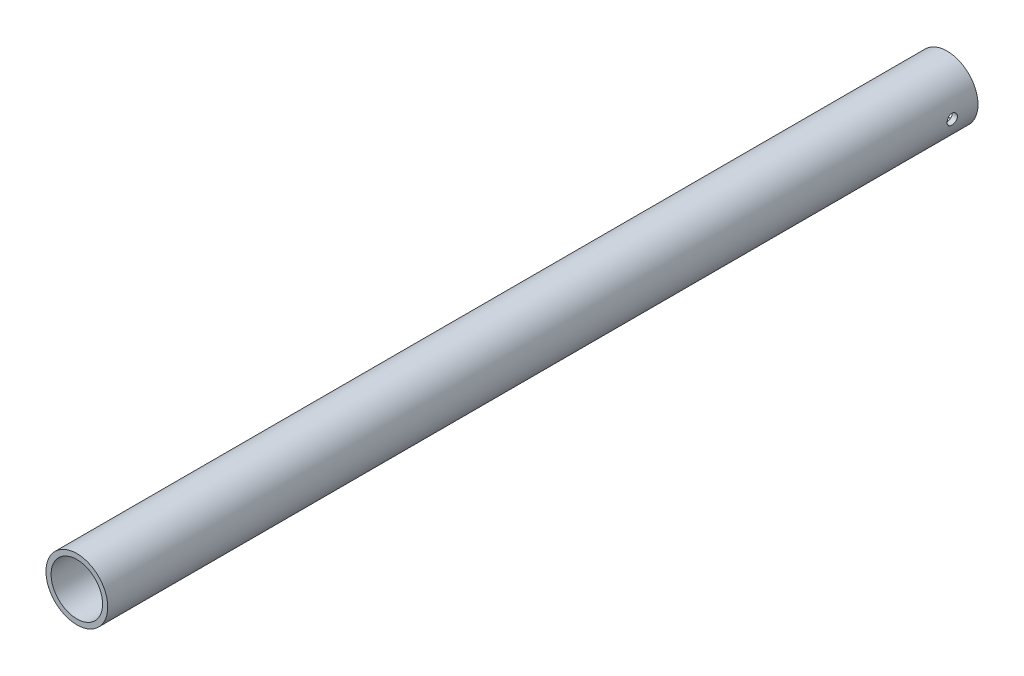
ISO-10303-21;
HEADER;
FILE_DESCRIPTION(('STEP AP214'),'2;1');
FILE_NAME('part.step','',(''),(''),'','','');
FILE_SCHEMA(('AUTOMOTIVE_DESIGN { 1 0 10303 214 1 1 1 1 }'));
ENDSEC;
DATA;
#1=APPLICATION_CONTEXT('core data for automotive mechanical design processes');
#2=APPLICATION_PROTOCOL_DEFINITION('international standard','automotive_design',2000,#1);
#3=PRODUCT_CONTEXT('',#1,'mechanical');
#4=PRODUCT('Part','Part','',(#3));
#5=PRODUCT_RELATED_PRODUCT_CATEGORY('part','',(#4));
#6=PRODUCT_DEFINITION_FORMATION('','',#4);
#7=PRODUCT_DEFINITION_CONTEXT('part definition',#1,'design');
#8=PRODUCT_DEFINITION('design','',#6,#7);
#9=PRODUCT_DEFINITION_SHAPE('','',#8);
#10=(LENGTH_UNIT() NAMED_UNIT(*) SI_UNIT(.MILLI.,.METRE.));
#11=(NAMED_UNIT(*) PLANE_ANGLE_UNIT() SI_UNIT($,.RADIAN.));
#12=(NAMED_UNIT(*) SI_UNIT($,.STERADIAN.) SOLID_ANGLE_UNIT());
#13=UNCERTAINTY_MEASURE_WITH_UNIT(LENGTH_MEASURE(1.E-05),#10,'distance_accuracy_value','');
#14=(GEOMETRIC_REPRESENTATION_CONTEXT(3) GLOBAL_UNCERTAINTY_ASSIGNED_CONTEXT((#13)) GLOBAL_UNIT_ASSIGNED_CONTEXT((#10,
#11,#12)) REPRESENTATION_CONTEXT('',''));
#15=CARTESIAN_POINT('',(0.,0.,0.));
#16=DIRECTION('',(0.,0.,1.));
#17=DIRECTION('',(1.,0.,0.));
#18=AXIS2_PLACEMENT_3D('',#15,#16,#17);
#19=CARTESIAN_POINT('',(0.,0.,169.));
#20=DIRECTION('',(0.,0.,1.));
#21=DIRECTION('',(1.,0.,0.));
#22=AXIS2_PLACEMENT_3D('',#19,#20,#21);
#23=PLANE('',#22);
#24=CARTESIAN_POINT('',(0.,0.,169.));
#25=DIRECTION('',(0.,0.,1.));
#26=DIRECTION('',(1.,0.,0.));
#27=AXIS2_PLACEMENT_3D('',#24,#25,#26);
#28=CIRCLE('',#27,6.);
#29=CARTESIAN_POINT('',(6.,0.,169.));
#30=VERTEX_POINT('',#29);
#31=EDGE_CURVE('E10',#30,#30,#28,.T.);
#32=ORIENTED_EDGE('',*,*,#31,.T.);
#33=EDGE_LOOP('',(#32));
#34=FACE_BOUND('',#33,.T.);
#35=CARTESIAN_POINT('',(0.,0.,169.));
#36=DIRECTION('',(0.,0.,1.));
#37=DIRECTION('',(1.,0.,0.));
#38=AXIS2_PLACEMENT_3D('',#35,#36,#37);
#39=CIRCLE('',#38,5.);
#40=CARTESIAN_POINT('',(5.,0.,169.));
#41=VERTEX_POINT('',#40);
#42=EDGE_CURVE('E49',#41,#41,#39,.T.);
#43=ORIENTED_EDGE('',*,*,#42,.F.);
#44=EDGE_LOOP('',(#43));
#45=FACE_BOUND('',#44,.T.);
#46=ADVANCED_FACE('F30',(#34,#45),#23,.T.);
#47=CARTESIAN_POINT('',(0.,0.,0.));
#48=DIRECTION('',(0.,0.,1.));
#49=DIRECTION('',(1.,0.,0.));
#50=AXIS2_PLACEMENT_3D('',#47,#48,#49);
#51=PLANE('',#50);
#52=CARTESIAN_POINT('',(0.,0.,0.));
#53=DIRECTION('',(0.,0.,1.));
#54=DIRECTION('',(1.,0.,0.));
#55=AXIS2_PLACEMENT_3D('',#52,#53,#54);
#56=CIRCLE('',#55,6.);
#57=CARTESIAN_POINT('',(6.,0.,0.));
#58=VERTEX_POINT('',#57);
#59=EDGE_CURVE('E44',#58,#58,#56,.T.);
#60=ORIENTED_EDGE('',*,*,#59,.F.);
#61=EDGE_LOOP('',(#60));
#62=FACE_BOUND('',#61,.T.);
#63=CARTESIAN_POINT('',(0.,0.,0.));
#64=DIRECTION('',(0.,0.,1.));
#65=DIRECTION('',(1.,0.,0.));
#66=AXIS2_PLACEMENT_3D('',#63,#64,#65);
#67=CIRCLE('',#66,5.);
#68=CARTESIAN_POINT('',(5.,0.,0.));
#69=VERTEX_POINT('',#68);
#70=EDGE_CURVE('E52',#69,#69,#67,.T.);
#71=ORIENTED_EDGE('',*,*,#70,.T.);
#72=EDGE_LOOP('',(#71));
#73=FACE_BOUND('',#72,.T.);
#74=ADVANCED_FACE('F88',(#62,#73),#51,.F.);
#75=CARTESIAN_POINT('',(0.,0.,169.));
#76=DIRECTION('',(0.,0.,-1.));
#77=DIRECTION('',(-1.,0.,0.));
#78=AXIS2_PLACEMENT_3D('',#75,#76,#77);
#79=CYLINDRICAL_SURFACE('',#78,6.);
#80=CARTESIAN_POINT('',(-6.,0.,4.));
#81=CARTESIAN_POINT('',(-5.9999990446753,0.0557563619832858,4.00000223557913));
#82=CARTESIAN_POINT('',(-5.99921471165214,0.111543152735528,4.00467890998757));
#83=CARTESIAN_POINT('',(-5.99616137976555,0.221552088669217,4.02325426350613));
#84=CARTESIAN_POINT('',(-5.99389101569556,0.275772747183699,4.03716142276464));
#85=CARTESIAN_POINT('',(-5.9881202729458,0.381041898885057,4.0737661794371));
#86=CARTESIAN_POINT('',(-5.98462090063677,0.43209294737276,4.09645658625623));
#87=CARTESIAN_POINT('',(-5.97677690832828,0.529656736791177,4.14996491682096));
#88=CARTESIAN_POINT('',(-5.97243238501774,0.576169995951436,4.1807819109932));
#89=CARTESIAN_POINT('',(-5.96333326983325,0.663789045716672,4.24998203352818));
#90=CARTESIAN_POINT('',(-5.95857548725943,0.704845161413987,4.28842764585445));
#91=CARTESIAN_POINT('',(-5.94921050750693,0.779955399463971,4.37165918738912));
#92=CARTESIAN_POINT('',(-5.94460331985067,0.814009079756388,4.41644551658264));
#93=CARTESIAN_POINT('',(-5.93603026303912,0.874346850242053,4.51142838647882));
#94=CARTESIAN_POINT('',(-5.93206851636654,0.9005818211444,4.5616565347219));
#95=CARTESIAN_POINT('',(-5.9252791591787,0.944223346164487,4.66588382572025));
#96=CARTESIAN_POINT('',(-5.92245147205723,0.961630496626245,4.71988271347105));
#97=CARTESIAN_POINT('',(-5.91828214737102,0.986965751113923,4.82959210994261));
#98=CARTESIAN_POINT('',(-5.9169270739428,0.99497961165416,4.88528229460056));
#99=CARTESIAN_POINT('',(-5.9158157557466,1.00156669011595,4.99723211075339));
#100=CARTESIAN_POINT('',(-5.91605939782886,1.0001405761556,5.05349170166692));
#101=CARTESIAN_POINT('',(-5.91810571545422,0.98795803935846,5.16437114451018));
#102=CARTESIAN_POINT('',(-5.91989229327567,0.977297952755909,5.21900192141809));
#103=CARTESIAN_POINT('',(-5.92479798084403,0.947101256161378,5.32568852713165));
#104=CARTESIAN_POINT('',(-5.92791713629309,0.927564341727896,5.37774426755542));
#105=CARTESIAN_POINT('',(-5.9351539173364,0.880070898437565,5.47809152937637));
#106=CARTESIAN_POINT('',(-5.9392762684293,0.852074365551885,5.52636376243249));
#107=CARTESIAN_POINT('',(-5.94805167366004,0.788484807022974,5.61756176021535));
#108=CARTESIAN_POINT('',(-5.95270477061715,0.752891168261715,5.66048709298197));
#109=CARTESIAN_POINT('',(-5.96208811151914,0.674592884863622,5.74033043432294));
#110=CARTESIAN_POINT('',(-5.96681859692661,0.631805585549251,5.77716740741603));
#111=CARTESIAN_POINT('',(-5.97577040558689,0.540614099592659,5.84315110506614));
#112=CARTESIAN_POINT('',(-5.97999172555898,0.492209876762569,5.87229778007329));
#113=CARTESIAN_POINT('',(-5.98745557157165,0.391082366466684,5.92208089085451));
#114=CARTESIAN_POINT('',(-5.99069727362979,0.338355490225864,5.9427101677325));
#115=CARTESIAN_POINT('',(-5.99583001205064,0.230119338241092,5.97479768609839));
#116=CARTESIAN_POINT('',(-5.9977211614019,0.174610295671787,5.98625669478949));
#117=CARTESIAN_POINT('',(-5.99992451937074,0.0630839605206495,5.99956854338445));
#118=CARTESIAN_POINT('',(-6.00025501205114,0.0070802948604045,6.00153262872224));
#119=CARTESIAN_POINT('',(-5.99934989768468,-0.104455909155955,5.99609546222875));
#120=CARTESIAN_POINT('',(-5.99811435089647,-0.159988465556816,5.98869457074651));
#121=CARTESIAN_POINT('',(-5.99422730775281,-0.268662470218705,5.96483006026581));
#122=CARTESIAN_POINT('',(-5.99158441920524,-0.321816347354152,5.94842151664395));
#123=CARTESIAN_POINT('',(-5.98517785782144,-0.424618753944177,5.90706619272019));
#124=CARTESIAN_POINT('',(-5.98141412204808,-0.474267086363888,5.88211893294589));
#125=CARTESIAN_POINT('',(-5.97313806520963,-0.569132275787583,5.82413955012129));
#126=CARTESIAN_POINT('',(-5.96861942354809,-0.614306100374859,5.7910379375331));
#127=CARTESIAN_POINT('',(-5.9593538695676,-0.698497434201075,5.71778507384598));
#128=CARTESIAN_POINT('',(-5.95460694068619,-0.737514495878633,5.67763331068933));
#129=CARTESIAN_POINT('',(-5.94536070094338,-0.8086971118632,5.59092098077143));
#130=CARTESIAN_POINT('',(-5.94086446454842,-0.840787504445486,5.54429833379424));
#131=CARTESIAN_POINT('',(-5.93268611911154,-0.896680924117994,5.44625881234458));
#132=CARTESIAN_POINT('',(-5.92900398426408,-0.920484213907929,5.394842089909));
#133=CARTESIAN_POINT('',(-5.92289381479082,-0.959015332589259,5.28888410687515));
#134=CARTESIAN_POINT('',(-5.92046061724426,-0.973780573019178,5.2343567619878));
#135=CARTESIAN_POINT('',(-5.91711086734105,-0.993934181511311,5.1235519483113));
#136=CARTESIAN_POINT('',(-5.91619418313089,-0.999323364778467,5.06727463210718));
#137=CARTESIAN_POINT('',(-5.91598693233605,-1.00054914641894,4.95531793361504));
#138=CARTESIAN_POINT('',(-5.9166762260226,-0.996504054450074,4.89963984856988));
#139=CARTESIAN_POINT('',(-5.91955912581491,-0.979231935582739,4.78976830077969));
#140=CARTESIAN_POINT('',(-5.92175272704486,-0.96600493844499,4.73557483322325));
#141=CARTESIAN_POINT('',(-5.92738942512688,-0.93078979583796,4.63025662508295));
#142=CARTESIAN_POINT('',(-5.93083106887868,-0.908811836240177,4.57912839597759));
#143=CARTESIAN_POINT('',(-5.93857747568883,-0.856730801566364,4.48126573232206));
#144=CARTESIAN_POINT('',(-5.9428822815536,-0.826627323499425,4.43453151585115));
#145=CARTESIAN_POINT('',(-5.95193381618249,-0.758727553748862,4.3461857667569));
#146=CARTESIAN_POINT('',(-5.95668518230521,-0.720844225437459,4.30464159331989));
#147=CARTESIAN_POINT('',(-5.96605748944336,-0.638643612552092,4.22845935821003));
#148=CARTESIAN_POINT('',(-5.97067840010619,-0.594324845165054,4.19382289254473));
#149=CARTESIAN_POINT('',(-5.97930611856888,-0.500147667856112,4.13222069272002));
#150=CARTESIAN_POINT('',(-5.98330846501242,-0.450253115013127,4.10530958427482));
#151=CARTESIAN_POINT('',(-5.9902046704071,-0.346605227751592,4.06029220615603));
#152=CARTESIAN_POINT('',(-5.99309963270993,-0.292855797932004,4.04217716756812));
#153=CARTESIAN_POINT('',(-5.99682316333182,-0.19908132401816,4.01919789034933));
#154=CARTESIAN_POINT('',(-5.99800810909344,-0.159623532119379,4.01201021215361));
#155=CARTESIAN_POINT('',(-5.99959686394448,-0.0801157241279235,4.0024105048621));
#156=CARTESIAN_POINT('',(-6.00000068648257,-0.0400657182433976,3.99999839354506));
#157=CARTESIAN_POINT('',(-6.,0.,4.));
#158=B_SPLINE_CURVE_WITH_KNOTS('',3,(#80,#81,#82,#83,#84,#85,#86,#87,#88,#89,#90,#91,#92,#93,
#94,#95,#96,#97,#98,#99,#100,#101,#102,#103,#104,#105,#106,#107,#108,#109,#110,#111,#112,#113,
#114,#115,#116,#117,#118,#119,#120,#121,#122,#123,#124,#125,#126,#127,#128,#129,#130,#131,#132,
#133,#134,#135,#136,#137,#138,#139,#140,#141,#142,#143,#144,#145,#146,#147,#148,#149,#150,#151,
#152,#153,#154,#155,#156,#157),.UNSPECIFIED.,.T.,.F.,(4,2,2,2,2,2,2,2,2,2,2,2,2,2,2,2,2,2,2,2,2,
2,2,2,2,2,2,2,2,2,2,2,2,2,2,2,2,2,4),(0.,0.167122633975404,0.334399018278168,0.501538746810108,
0.668659365069916,0.837209964249328,1.00577120067943,1.17537008329536,1.34495750750472,
1.51298430841369,1.68099921728354,1.84728208704163,2.01357066010152,2.18065822653023,
2.34775928272229,2.51693107964531,2.68610396654339,2.85541875566361,3.02471937808459,
3.19203153396559,3.35933725214344,3.52563122802566,3.69193454330426,3.85970730250809,
4.02749225221713,4.19701528803047,4.36653294950377,4.53534408936709,4.70414055114647,
4.8708316380908,5.03752218475253,5.20401927290489,5.37052462011734,5.53900553677357,
5.70752533551589,5.8772089264288,6.04672300852029,6.16681699265607,6.28690890910787),.UNSPECIFIED.);
#159=CARTESIAN_POINT('',(-6.,0.,4.));
#160=VERTEX_POINT('',#159);
#161=EDGE_CURVE('E77',#160,#160,#158,.T.);
#162=ORIENTED_EDGE('',*,*,#161,.T.);
#163=EDGE_LOOP('',(#162));
#164=FACE_BOUND('',#163,.T.);
#165=CARTESIAN_POINT('',(6.,0.,4.));
#166=CARTESIAN_POINT('',(5.99999904467529,-0.0557563619832859,4.00000223557913));
#167=CARTESIAN_POINT('',(5.99921471165214,-0.111543152735528,4.00467890998757));
#168=CARTESIAN_POINT('',(5.99616137976555,-0.221552088669217,4.02325426350613));
#169=CARTESIAN_POINT('',(5.99389101569556,-0.275772747183699,4.03716142276464));
#170=CARTESIAN_POINT('',(5.9881202729458,-0.381041898885058,4.0737661794371));
#171=CARTESIAN_POINT('',(5.98462090063677,-0.43209294737276,4.09645658625623));
#172=CARTESIAN_POINT('',(5.97677690832828,-0.529656736791178,4.14996491682096));
#173=CARTESIAN_POINT('',(5.97243238501774,-0.576169995951436,4.1807819109932));
#174=CARTESIAN_POINT('',(5.96333326983325,-0.663789045716672,4.24998203352818));
#175=CARTESIAN_POINT('',(5.95857548725943,-0.704845161413987,4.28842764585445));
#176=CARTESIAN_POINT('',(5.94921050750693,-0.779955399463971,4.37165918738912));
#177=CARTESIAN_POINT('',(5.94460331985067,-0.814009079756389,4.41644551658264));
#178=CARTESIAN_POINT('',(5.93603026303912,-0.874346850242053,4.51142838647882));
#179=CARTESIAN_POINT('',(5.93206851636655,-0.9005818211444,4.5616565347219));
#180=CARTESIAN_POINT('',(5.9252791591787,-0.944223346164487,4.66588382572025));
#181=CARTESIAN_POINT('',(5.92245147205723,-0.961630496626245,4.71988271347105));
#182=CARTESIAN_POINT('',(5.91828214737102,-0.986965751113923,4.82959210994262));
#183=CARTESIAN_POINT('',(5.9169270739428,-0.99497961165416,4.88528229460056));
#184=CARTESIAN_POINT('',(5.9158157557466,-1.00156669011595,4.99723211075339));
#185=CARTESIAN_POINT('',(5.91605939782886,-1.0001405761556,5.05349170166692));
#186=CARTESIAN_POINT('',(5.91810571545422,-0.98795803935846,5.16437114451018));
#187=CARTESIAN_POINT('',(5.91989229327567,-0.977297952755909,5.21900192141809));
#188=CARTESIAN_POINT('',(5.92479798084403,-0.947101256161378,5.32568852713165));
#189=CARTESIAN_POINT('',(5.92791713629309,-0.927564341727896,5.37774426755542));
#190=CARTESIAN_POINT('',(5.9351539173364,-0.880070898437565,5.47809152937637));
#191=CARTESIAN_POINT('',(5.9392762684293,-0.852074365551885,5.52636376243249));
#192=CARTESIAN_POINT('',(5.94805167366004,-0.788484807022973,5.61756176021535));
#193=CARTESIAN_POINT('',(5.95270477061715,-0.752891168261715,5.66048709298197));
#194=CARTESIAN_POINT('',(5.96208811151914,-0.674592884863622,5.74033043432294));
#195=CARTESIAN_POINT('',(5.96681859692661,-0.631805585549251,5.77716740741603));
#196=CARTESIAN_POINT('',(5.97577040558689,-0.540614099592658,5.84315110506614));
#197=CARTESIAN_POINT('',(5.97999172555898,-0.492209876762569,5.87229778007329));
#198=CARTESIAN_POINT('',(5.98745557157165,-0.391082366466684,5.92208089085451));
#199=CARTESIAN_POINT('',(5.99069727362979,-0.338355490225864,5.9427101677325));
#200=CARTESIAN_POINT('',(5.99583001205064,-0.230119338241093,5.97479768609839));
#201=CARTESIAN_POINT('',(5.9977211614019,-0.174610295671787,5.98625669478949));
#202=CARTESIAN_POINT('',(5.99992451937074,-0.0630839605206495,5.99956854338445));
#203=CARTESIAN_POINT('',(6.00025501205114,-0.00708029486040434,6.00153262872224));
#204=CARTESIAN_POINT('',(5.99934989768468,0.104455909155955,5.99609546222875));
#205=CARTESIAN_POINT('',(5.99811435089647,0.159988465556816,5.98869457074651));
#206=CARTESIAN_POINT('',(5.99422730775281,0.268662470218706,5.96483006026581));
#207=CARTESIAN_POINT('',(5.99158441920524,0.321816347354152,5.94842151664395));
#208=CARTESIAN_POINT('',(5.98517785782144,0.424618753944177,5.90706619272019));
#209=CARTESIAN_POINT('',(5.98141412204808,0.474267086363888,5.88211893294589));
#210=CARTESIAN_POINT('',(5.97313806520963,0.569132275787584,5.82413955012129));
#211=CARTESIAN_POINT('',(5.96861942354809,0.614306100374859,5.7910379375331));
#212=CARTESIAN_POINT('',(5.9593538695676,0.698497434201075,5.71778507384598));
#213=CARTESIAN_POINT('',(5.95460694068619,0.737514495878633,5.67763331068933));
#214=CARTESIAN_POINT('',(5.94536070094338,0.808697111863201,5.59092098077143));
#215=CARTESIAN_POINT('',(5.94086446454842,0.840787504445486,5.54429833379424));
#216=CARTESIAN_POINT('',(5.93268611911154,0.896680924117994,5.44625881234458));
#217=CARTESIAN_POINT('',(5.92900398426408,0.920484213907929,5.394842089909));
#218=CARTESIAN_POINT('',(5.92289381479082,0.95901533258926,5.28888410687515));
#219=CARTESIAN_POINT('',(5.92046061724426,0.973780573019178,5.2343567619878));
#220=CARTESIAN_POINT('',(5.91711086734104,0.993934181511311,5.12355194831129));
#221=CARTESIAN_POINT('',(5.91619418313089,0.999323364778467,5.06727463210718));
#222=CARTESIAN_POINT('',(5.91598693233605,1.00054914641894,4.95531793361504));
#223=CARTESIAN_POINT('',(5.9166762260226,0.996504054450074,4.89963984856988));
#224=CARTESIAN_POINT('',(5.91955912581491,0.979231935582739,4.78976830077969));
#225=CARTESIAN_POINT('',(5.92175272704486,0.96600493844499,4.73557483322325));
#226=CARTESIAN_POINT('',(5.92738942512688,0.93078979583796,4.63025662508295));
#227=CARTESIAN_POINT('',(5.93083106887868,0.908811836240176,4.57912839597759));
#228=CARTESIAN_POINT('',(5.93857747568883,0.856730801566363,4.48126573232206));
#229=CARTESIAN_POINT('',(5.9428822815536,0.826627323499425,4.43453151585115));
#230=CARTESIAN_POINT('',(5.95193381618249,0.758727553748862,4.3461857667569));
#231=CARTESIAN_POINT('',(5.95668518230521,0.720844225437459,4.30464159331989));
#232=CARTESIAN_POINT('',(5.96605748944336,0.638643612552092,4.22845935821003));
#233=CARTESIAN_POINT('',(5.97067840010619,0.594324845165054,4.19382289254473));
#234=CARTESIAN_POINT('',(5.97930611856888,0.500147667856111,4.13222069272002));
#235=CARTESIAN_POINT('',(5.98330846501242,0.450253115013126,4.10530958427482));
#236=CARTESIAN_POINT('',(5.9902046704071,0.346605227751591,4.06029220615603));
#237=CARTESIAN_POINT('',(5.99309963270993,0.292855797932003,4.04217716756812));
#238=CARTESIAN_POINT('',(5.99682316333182,0.199081324018159,4.01919789034933));
#239=CARTESIAN_POINT('',(5.99800810909344,0.159623532119378,4.01201021215361));
#240=CARTESIAN_POINT('',(5.99959686394448,0.080115724127923,4.0024105048621));
#241=CARTESIAN_POINT('',(6.00000068648256,0.0400657182433974,3.99999839354506));
#242=CARTESIAN_POINT('',(6.,0.,4.));
#243=B_SPLINE_CURVE_WITH_KNOTS('',3,(#165,#166,#167,#168,#169,#170,#171,#172,#173,#174,#175,
#176,#177,#178,#179,#180,#181,#182,#183,#184,#185,#186,#187,#188,#189,#190,#191,#192,#193,#194,
#195,#196,#197,#198,#199,#200,#201,#202,#203,#204,#205,#206,#207,#208,#209,#210,#211,#212,#213,
#214,#215,#216,#217,#218,#219,#220,#221,#222,#223,#224,#225,#226,#227,#228,#229,#230,#231,#232,
#233,#234,#235,#236,#237,#238,#239,#240,#241,#242),.UNSPECIFIED.,.T.,.F.,(4,2,2,2,2,2,2,2,2,2,2,
2,2,2,2,2,2,2,2,2,2,2,2,2,2,2,2,2,2,2,2,2,2,2,2,2,2,2,4),(0.,0.167122633975404,
0.334399018278168,0.501538746810108,0.668659365069916,0.837209964249328,1.00577120067943,
1.17537008329536,1.34495750750472,1.51298430841369,1.68099921728354,1.84728208704163,
2.01357066010152,2.18065822653023,2.34775928272229,2.51693107964531,2.68610396654339,
2.85541875566361,3.02471937808459,3.19203153396559,3.35933725214344,3.52563122802566,
3.69193454330427,3.85970730250809,4.02749225221713,4.19701528803048,4.36653294950377,
4.53534408936709,4.70414055114647,4.8708316380908,5.03752218475253,5.20401927290489,
5.37052462011734,5.53900553677357,5.70752533551589,5.8772089264288,6.04672300852029,
6.16681699265607,6.28690890910787),.UNSPECIFIED.);
#244=CARTESIAN_POINT('',(6.,0.,4.));
#245=VERTEX_POINT('',#244);
#246=EDGE_CURVE('E72',#245,#245,#243,.T.);
#247=ORIENTED_EDGE('',*,*,#246,.T.);
#248=EDGE_LOOP('',(#247));
#249=FACE_BOUND('',#248,.T.);
#250=ORIENTED_EDGE('',*,*,#31,.F.);
#251=EDGE_LOOP('',(#250));
#252=FACE_BOUND('',#251,.T.);
#253=ORIENTED_EDGE('',*,*,#59,.T.);
#254=EDGE_LOOP('',(#253));
#255=FACE_BOUND('',#254,.T.);
#256=ADVANCED_FACE('F32',(#164,#249,#252,#255),#79,.T.);
#257=CARTESIAN_POINT('',(0.,0.,169.));
#258=DIRECTION('',(0.,0.,-1.));
#259=DIRECTION('',(-1.,0.,0.));
#260=AXIS2_PLACEMENT_3D('',#257,#258,#259);
#261=CYLINDRICAL_SURFACE('',#260,5.);
#262=CARTESIAN_POINT('',(-5.,0.,5.99999999999998));
#263=CARTESIAN_POINT('',(-4.99999897580871,-0.0555769067926343,5.99999795550163));
#264=CARTESIAN_POINT('',(-4.99906385178231,-0.111179660201525,5.99535115703235));
#265=CARTESIAN_POINT('',(-4.99542365623231,-0.220813507689021,5.97690149988476));
#266=CARTESIAN_POINT('',(-4.99271717860186,-0.274843317541356,5.96309136719849));
#267=CARTESIAN_POINT('',(-4.98583649278287,-0.379730305263312,5.92675872637921));
#268=CARTESIAN_POINT('',(-4.98166369076718,-0.430590467933133,5.90424456315531));
#269=CARTESIAN_POINT('',(-4.97230398035314,-0.527807988864225,5.85116775248871));
#270=CARTESIAN_POINT('',(-4.96711713235707,-0.574165615075811,5.8206055843928));
#271=CARTESIAN_POINT('',(-4.9562216532997,-0.661693477314865,5.75186150570857));
#272=CARTESIAN_POINT('',(-4.95050745504347,-0.702793951158524,5.7135916446088));
#273=CARTESIAN_POINT('',(-4.93924180452588,-0.778036756608028,5.6307075836083));
#274=CARTESIAN_POINT('',(-4.93369036500424,-0.812178544770424,5.58609288866488));
#275=CARTESIAN_POINT('',(-4.92332441812615,-0.87283175334762,5.49128380698813));
#276=CARTESIAN_POINT('',(-4.91851707364946,-0.899270938865866,5.44104235620364));
#277=CARTESIAN_POINT('',(-4.91026268058418,-0.943305666580308,5.33671818099592));
#278=CARTESIAN_POINT('',(-4.90681549761962,-0.960902082437237,5.28263583665366));
#279=CARTESIAN_POINT('',(-4.90172805252204,-0.986525299884827,5.17291563609208));
#280=CARTESIAN_POINT('',(-4.90006470107188,-0.994674497958777,5.11730745585777));
#281=CARTESIAN_POINT('',(-4.89866375060627,-1.00155212772612,5.00549017863566));
#282=CARTESIAN_POINT('',(-4.89892595467841,-1.0002815227135,4.94928114367985));
#283=CARTESIAN_POINT('',(-4.90132551148185,-0.988454573101819,4.838753211979));
#284=CARTESIAN_POINT('',(-4.90343452858763,-0.978038540243905,4.78441859437269));
#285=CARTESIAN_POINT('',(-4.90924546160001,-0.94843788462305,4.678283923337));
#286=CARTESIAN_POINT('',(-4.91294745357779,-0.929252843100681,4.62648399108099));
#287=CARTESIAN_POINT('',(-4.92155618500408,-0.88252478367472,4.5264847382964));
#288=CARTESIAN_POINT('',(-4.92647089813704,-0.854926151232115,4.47831212043083));
#289=CARTESIAN_POINT('',(-4.93694618773062,-0.79219357457268,4.38722915002719));
#290=CARTESIAN_POINT('',(-4.94250683838366,-0.757058764356829,4.34431940314884));
#291=CARTESIAN_POINT('',(-4.95377021241462,-0.679499934560584,4.26417059754306));
#292=CARTESIAN_POINT('',(-4.95947369210905,-0.636956161212445,4.22704743214087));
#293=CARTESIAN_POINT('',(-4.97028848714408,-0.54618502406201,4.16044615369878));
#294=CARTESIAN_POINT('',(-4.97539979488974,-0.497957587379389,4.13096813870642));
#295=CARTESIAN_POINT('',(-4.98446690160887,-0.397059386878921,4.08047249077403));
#296=CARTESIAN_POINT('',(-4.98842088848272,-0.3443818195853,4.05946810635546));
#297=CARTESIAN_POINT('',(-4.99471408987858,-0.236148976448665,4.02663952596143));
#298=CARTESIAN_POINT('',(-4.99705350000531,-0.18059405007245,4.01481421792637));
#299=CARTESIAN_POINT('',(-4.99982671866868,-0.0691794056271507,4.00084354620572));
#300=CARTESIAN_POINT('',(-5.0002917465247,-0.0133403283255765,3.99853958045973));
#301=CARTESIAN_POINT('',(-4.99935051930103,0.0979249341927137,4.00324985894218));
#302=CARTESIAN_POINT('',(-4.99794436941446,0.153351142443793,4.0102635793526));
#303=CARTESIAN_POINT('',(-4.99343832008018,0.26170565994654,4.03327837354396));
#304=CARTESIAN_POINT('',(-4.99035376404206,0.314651948339902,4.0491980684979));
#305=CARTESIAN_POINT('',(-4.98283552061033,0.417123627499666,4.08948398265581));
#306=CARTESIAN_POINT('',(-4.97840173214227,0.466648761637539,4.11385083467683));
#307=CARTESIAN_POINT('',(-4.96859911533294,0.561541173686217,4.17068249065131));
#308=CARTESIAN_POINT('',(-4.96321950437052,0.606850126752187,4.20324278103894));
#309=CARTESIAN_POINT('',(-4.95214734829882,0.691418019119205,4.27540919120728));
#310=CARTESIAN_POINT('',(-4.94645476968388,0.730676308930762,4.31501606639987));
#311=CARTESIAN_POINT('',(-4.93529303556965,0.802640590774175,4.40087335189112));
#312=CARTESIAN_POINT('',(-4.92982860233304,0.835237702448654,4.44721574422134));
#313=CARTESIAN_POINT('',(-4.91984191796194,0.892185420051205,4.54481136135668));
#314=CARTESIAN_POINT('',(-4.91531962913342,0.916536355922902,4.59606438957355));
#315=CARTESIAN_POINT('',(-4.90776740584383,0.95615184158196,4.70176824614955));
#316=CARTESIAN_POINT('',(-4.90472974872187,0.971463499791051,4.75620084121032));
#317=CARTESIAN_POINT('',(-4.90047436792025,0.992708651627196,4.8669334534909));
#318=CARTESIAN_POINT('',(-4.89925640691111,0.998643368225112,4.92323322620935));
#319=CARTESIAN_POINT('',(-4.89879149631379,1.00092091086747,5.03500886454432));
#320=CARTESIAN_POINT('',(-4.89950919189301,0.997435788070896,5.09048114892701));
#321=CARTESIAN_POINT('',(-4.90275573484614,0.981352304100061,5.20003164990503));
#322=CARTESIAN_POINT('',(-4.90528456767169,0.968754016129298,5.2541098776948));
#323=CARTESIAN_POINT('',(-4.91185264219159,0.934878568498954,5.35922771124055));
#324=CARTESIAN_POINT('',(-4.91588821018831,0.913622506717345,5.41027436050242));
#325=CARTESIAN_POINT('',(-4.9250171497417,0.863054644601604,5.50810372073444));
#326=CARTESIAN_POINT('',(-4.93011060998894,0.833742168774883,5.55488607372514));
#327=CARTESIAN_POINT('',(-4.94088960523225,0.767305914786415,5.64371557215031));
#328=CARTESIAN_POINT('',(-4.94658372909699,0.730057887235181,5.68566876526759));
#329=CARTESIAN_POINT('',(-4.95786081871955,0.649064369013141,5.76278620552917));
#330=CARTESIAN_POINT('',(-4.96344375863184,0.605317387153335,5.79794889031727));
#331=CARTESIAN_POINT('',(-4.97393832387971,0.512017629088246,5.86083464394645));
#332=CARTESIAN_POINT('',(-4.97884231219246,0.462408884429834,5.88847600328003));
#333=CARTESIAN_POINT('',(-4.98735125085,0.359166360940732,5.93498612259659));
#334=CARTESIAN_POINT('',(-4.99095737138616,0.305536260863125,5.95386278953249));
#335=CARTESIAN_POINT('',(-4.99576372595371,0.20982148892378,5.97865194804472));
#336=CARTESIAN_POINT('',(-4.99734303158452,0.168281664013786,5.98664319370776));
#337=CARTESIAN_POINT('',(-4.99946154139893,0.0844995252100682,5.99731791235836));
#338=CARTESIAN_POINT('',(-5.00000077873155,0.0422572337486197,6.00000155450975));
#339=CARTESIAN_POINT('',(-5.,0.,5.99999999999998));
#340=B_SPLINE_CURVE_WITH_KNOTS('',3,(#262,#263,#264,#265,#266,#267,#268,#269,#270,#271,#272,
#273,#274,#275,#276,#277,#278,#279,#280,#281,#282,#283,#284,#285,#286,#287,#288,#289,#290,#291,
#292,#293,#294,#295,#296,#297,#298,#299,#300,#301,#302,#303,#304,#305,#306,#307,#308,#309,#310,
#311,#312,#313,#314,#315,#316,#317,#318,#319,#320,#321,#322,#323,#324,#325,#326,#327,#328,#329,
#330,#331,#332,#333,#334,#335,#336,#337,#338,#339),.UNSPECIFIED.,.T.,.F.,(4,2,2,2,2,2,2,2,2,2,2,
2,2,2,2,2,2,2,2,2,2,2,2,2,2,2,2,2,2,2,2,2,2,2,2,2,2,2,4),(0.,0.166576130661259,
0.333284650691321,0.499833735250338,0.66637290223086,0.834932670112184,1.00350559674736,
1.17361195005922,1.34370149365197,1.51156185103587,1.67940504281225,1.84471727006278,
2.01003739253729,2.17647490203592,2.3429315474967,2.5123825249135,2.6818356753982,
2.85155274854024,3.02124925698036,3.18810735676265,3.35495607657867,3.52030453950723,
3.68566539216022,3.85305066033358,4.0204538834593,4.19040628579225,4.36035188723466,
4.52940381032723,4.69843368330414,4.86439722567701,5.03035943492608,5.1959196125311,
5.36149367581866,5.52988076239143,5.6983065453293,5.86849496675637,6.03852955517518,
6.16518775289893,6.29184191370996),.UNSPECIFIED.);
#341=CARTESIAN_POINT('',(-5.,0.,5.99999999999998));
#342=VERTEX_POINT('',#341);
#343=EDGE_CURVE('E35',#342,#342,#340,.T.);
#344=ORIENTED_EDGE('',*,*,#343,.F.);
#345=EDGE_LOOP('',(#344));
#346=FACE_BOUND('',#345,.T.);
#347=CARTESIAN_POINT('',(5.,0.,4.));
#348=CARTESIAN_POINT('',(4.99999897580871,-0.0555769067926332,4.00000204449834));
#349=CARTESIAN_POINT('',(4.99906385178231,-0.111179660201522,4.00464884296765));
#350=CARTESIAN_POINT('',(4.99542365623231,-0.220813507689019,4.02309850011525));
#351=CARTESIAN_POINT('',(4.99271717860186,-0.274843317541356,4.03690863280151));
#352=CARTESIAN_POINT('',(4.98583649278287,-0.379730305263313,4.07324127362079));
#353=CARTESIAN_POINT('',(4.98166369076718,-0.430590467933134,4.09575543684469));
#354=CARTESIAN_POINT('',(4.97230398035314,-0.527807988864226,4.14883224751129));
#355=CARTESIAN_POINT('',(4.96711713235707,-0.574165615075812,4.17939441560721));
#356=CARTESIAN_POINT('',(4.9562216532997,-0.661693477314865,4.24813849429143));
#357=CARTESIAN_POINT('',(4.95050745504347,-0.702793951158524,4.2864083553912));
#358=CARTESIAN_POINT('',(4.93924180452588,-0.778036756608028,4.3692924163917));
#359=CARTESIAN_POINT('',(4.93369036500424,-0.812178544770425,4.41390711133512));
#360=CARTESIAN_POINT('',(4.92332441812615,-0.87283175334762,4.50871619301188));
#361=CARTESIAN_POINT('',(4.91851707364946,-0.899270938865866,4.55895764379636));
#362=CARTESIAN_POINT('',(4.91026268058418,-0.943305666580308,4.66328181900408));
#363=CARTESIAN_POINT('',(4.90681549761962,-0.960902082437238,4.71736416334635));
#364=CARTESIAN_POINT('',(4.90172805252204,-0.986525299884827,4.82708436390792));
#365=CARTESIAN_POINT('',(4.90006470107188,-0.994674497958777,4.88269254414223));
#366=CARTESIAN_POINT('',(4.89866375060627,-1.00155212772612,4.99450982136434));
#367=CARTESIAN_POINT('',(4.89892595467841,-1.0002815227135,5.05071885632015));
#368=CARTESIAN_POINT('',(4.90132551148185,-0.988454573101819,5.161246788021));
#369=CARTESIAN_POINT('',(4.90343452858763,-0.978038540243905,5.21558140562732));
#370=CARTESIAN_POINT('',(4.90924546160001,-0.94843788462305,5.321716076663));
#371=CARTESIAN_POINT('',(4.91294745357779,-0.92925284310068,5.37351600891901));
#372=CARTESIAN_POINT('',(4.92155618500408,-0.88252478367472,5.4735152617036));
#373=CARTESIAN_POINT('',(4.92647089813704,-0.854926151232114,5.52168787956917));
#374=CARTESIAN_POINT('',(4.93694618773062,-0.792193574572679,5.61277084997281));
#375=CARTESIAN_POINT('',(4.94250683838366,-0.757058764356829,5.65568059685116));
#376=CARTESIAN_POINT('',(4.95377021241462,-0.679499934560584,5.73582940245694));
#377=CARTESIAN_POINT('',(4.95947369210905,-0.636956161212445,5.77295256785913));
#378=CARTESIAN_POINT('',(4.97028848714408,-0.54618502406201,5.83955384630122));
#379=CARTESIAN_POINT('',(4.97539979488974,-0.497957587379389,5.86903186129358));
#380=CARTESIAN_POINT('',(4.98446690160887,-0.397059386878921,5.91952750922597));
#381=CARTESIAN_POINT('',(4.98842088848272,-0.3443818195853,5.94053189364454));
#382=CARTESIAN_POINT('',(4.99471408987858,-0.236148976448665,5.97336047403857));
#383=CARTESIAN_POINT('',(4.99705350000531,-0.18059405007245,5.98518578207363));
#384=CARTESIAN_POINT('',(4.99982671866868,-0.0691794056271504,5.99915645379428));
#385=CARTESIAN_POINT('',(5.0002917465247,-0.0133403283255762,6.00146041954027));
#386=CARTESIAN_POINT('',(4.99935051930103,0.097924934192714,5.99675014105782));
#387=CARTESIAN_POINT('',(4.99794436941446,0.153351142443793,5.9897364206474));
#388=CARTESIAN_POINT('',(4.99343832008018,0.261705659946541,5.96672162645604));
#389=CARTESIAN_POINT('',(4.99035376404206,0.314651948339903,5.9508019315021));
#390=CARTESIAN_POINT('',(4.98283552061033,0.417123627499667,5.91051601734419));
#391=CARTESIAN_POINT('',(4.97840173214227,0.46664876163754,5.88614916532317));
#392=CARTESIAN_POINT('',(4.96859911533294,0.561541173686218,5.82931750934869));
#393=CARTESIAN_POINT('',(4.96321950437052,0.606850126752188,5.79675721896105));
#394=CARTESIAN_POINT('',(4.95214734829882,0.691418019119207,5.72459080879272));
#395=CARTESIAN_POINT('',(4.94645476968388,0.730676308930762,5.68498393360013));
#396=CARTESIAN_POINT('',(4.93529303556965,0.802640590774176,5.59912664810888));
#397=CARTESIAN_POINT('',(4.92982860233304,0.835237702448655,5.55278425577866));
#398=CARTESIAN_POINT('',(4.91984191796194,0.892185420051205,5.45518863864332));
#399=CARTESIAN_POINT('',(4.91531962913342,0.916536355922902,5.40393561042645));
#400=CARTESIAN_POINT('',(4.90776740584383,0.95615184158196,5.29823175385045));
#401=CARTESIAN_POINT('',(4.90472974872187,0.97146349979105,5.24379915878968));
#402=CARTESIAN_POINT('',(4.90047436792025,0.992708651627196,5.1330665465091));
#403=CARTESIAN_POINT('',(4.89925640691111,0.998643368225112,5.07676677379065));
#404=CARTESIAN_POINT('',(4.89879149631379,1.00092091086747,4.96499113545568));
#405=CARTESIAN_POINT('',(4.89950919189301,0.997435788070896,4.90951885107299));
#406=CARTESIAN_POINT('',(4.90275573484614,0.98135230410006,4.79996835009497));
#407=CARTESIAN_POINT('',(4.90528456767169,0.968754016129298,4.74589012230519));
#408=CARTESIAN_POINT('',(4.91185264219159,0.934878568498954,4.64077228875946));
#409=CARTESIAN_POINT('',(4.91588821018831,0.913622506717344,4.58972563949758));
#410=CARTESIAN_POINT('',(4.9250171497417,0.863054644601604,4.49189627926556));
#411=CARTESIAN_POINT('',(4.93011060998894,0.833742168774882,4.44511392627486));
#412=CARTESIAN_POINT('',(4.94088960523225,0.767305914786414,4.35628442784969));
#413=CARTESIAN_POINT('',(4.94658372909699,0.730057887235181,4.31433123473241));
#414=CARTESIAN_POINT('',(4.95786081871955,0.649064369013141,4.23721379447083));
#415=CARTESIAN_POINT('',(4.96344375863184,0.605317387153335,4.20205110968273));
#416=CARTESIAN_POINT('',(4.97393832387971,0.512017629088246,4.13916535605355));
#417=CARTESIAN_POINT('',(4.97884231219246,0.462408884429835,4.11152399671998));
#418=CARTESIAN_POINT('',(4.98735125085,0.359166360940732,4.06501387740341));
#419=CARTESIAN_POINT('',(4.99095737138616,0.305536260863126,4.04613721046751));
#420=CARTESIAN_POINT('',(4.99576372595371,0.209821488923779,4.02134805195529));
#421=CARTESIAN_POINT('',(4.99734303158452,0.168281664013784,4.01335680629224));
#422=CARTESIAN_POINT('',(4.99946154139893,0.0844995252100669,4.00268208764164));
#423=CARTESIAN_POINT('',(5.00000077873155,0.042257233748619,3.99999844549023));
#424=CARTESIAN_POINT('',(5.,0.,4.));
#425=B_SPLINE_CURVE_WITH_KNOTS('',3,(#347,#348,#349,#350,#351,#352,#353,#354,#355,#356,#357,
#358,#359,#360,#361,#362,#363,#364,#365,#366,#367,#368,#369,#370,#371,#372,#373,#374,#375,#376,
#377,#378,#379,#380,#381,#382,#383,#384,#385,#386,#387,#388,#389,#390,#391,#392,#393,#394,#395,
#396,#397,#398,#399,#400,#401,#402,#403,#404,#405,#406,#407,#408,#409,#410,#411,#412,#413,#414,
#415,#416,#417,#418,#419,#420,#421,#422,#423,#424),.UNSPECIFIED.,.T.,.F.,(4,2,2,2,2,2,2,2,2,2,2,
2,2,2,2,2,2,2,2,2,2,2,2,2,2,2,2,2,2,2,2,2,2,2,2,2,2,2,4),(0.,0.166576130661258,
0.333284650691323,0.499833735250341,0.666372902230863,0.834932670112186,1.00350559674737,
1.17361195005923,1.34370149365197,1.51156185103587,1.67940504281225,1.84471727006278,
2.0100373925373,2.17647490203592,2.3429315474967,2.51238252491351,2.6818356753982,
2.85155274854024,3.02124925698036,3.18810735676265,3.35495607657867,3.52030453950723,
3.68566539216022,3.85305066033359,4.0204538834593,4.19040628579226,4.36035188723466,
4.52940381032723,4.69843368330415,4.86439722567701,5.03035943492608,5.1959196125311,
5.36149367581866,5.52988076239143,5.6983065453293,5.86849496675637,6.03852955517518,
6.16518775289894,6.29184191370996),.UNSPECIFIED.);
#426=CARTESIAN_POINT('',(5.,0.,4.));
#427=VERTEX_POINT('',#426);
#428=EDGE_CURVE('E54',#427,#427,#425,.T.);
#429=ORIENTED_EDGE('',*,*,#428,.F.);
#430=EDGE_LOOP('',(#429));
#431=FACE_BOUND('',#430,.T.);
#432=ORIENTED_EDGE('',*,*,#42,.T.);
#433=EDGE_LOOP('',(#432));
#434=FACE_BOUND('',#433,.T.);
#435=ORIENTED_EDGE('',*,*,#70,.F.);
#436=EDGE_LOOP('',(#435));
#437=FACE_BOUND('',#436,.T.);
#438=ADVANCED_FACE('F59',(#346,#431,#434,#437),#261,.F.);
#439=CARTESIAN_POINT('',(-6.,0.,5.));
#440=DIRECTION('',(1.,0.,0.));
#441=DIRECTION('',(0.,0.,-1.));
#442=AXIS2_PLACEMENT_3D('',#439,#440,#441);
#443=CYLINDRICAL_SURFACE('',#442,1.);
#444=ORIENTED_EDGE('',*,*,#428,.T.);
#445=EDGE_LOOP('',(#444));
#446=FACE_BOUND('',#445,.T.);
#447=ORIENTED_EDGE('',*,*,#246,.F.);
#448=EDGE_LOOP('',(#447));
#449=FACE_BOUND('',#448,.T.);
#450=ADVANCED_FACE('F65',(#446,#449),#443,.F.);
#451=ORIENTED_EDGE('',*,*,#343,.T.);
#452=EDGE_LOOP('',(#451));
#453=FACE_BOUND('',#452,.T.);
#454=ORIENTED_EDGE('',*,*,#161,.F.);
#455=EDGE_LOOP('',(#454));
#456=FACE_BOUND('',#455,.T.);
#457=ADVANCED_FACE('F62',(#453,#456),#443,.F.);
#458=CLOSED_SHELL('',(#46,#74,#256,#438,#450,#457));
#459=MANIFOLD_SOLID_BREP('B2',#458);
#460=ADVANCED_BREP_SHAPE_REPRESENTATION('',(#18,#459),#14);
#461=SHAPE_DEFINITION_REPRESENTATION(#9,#460);
ENDSEC;
END-ISO-10303-21;
